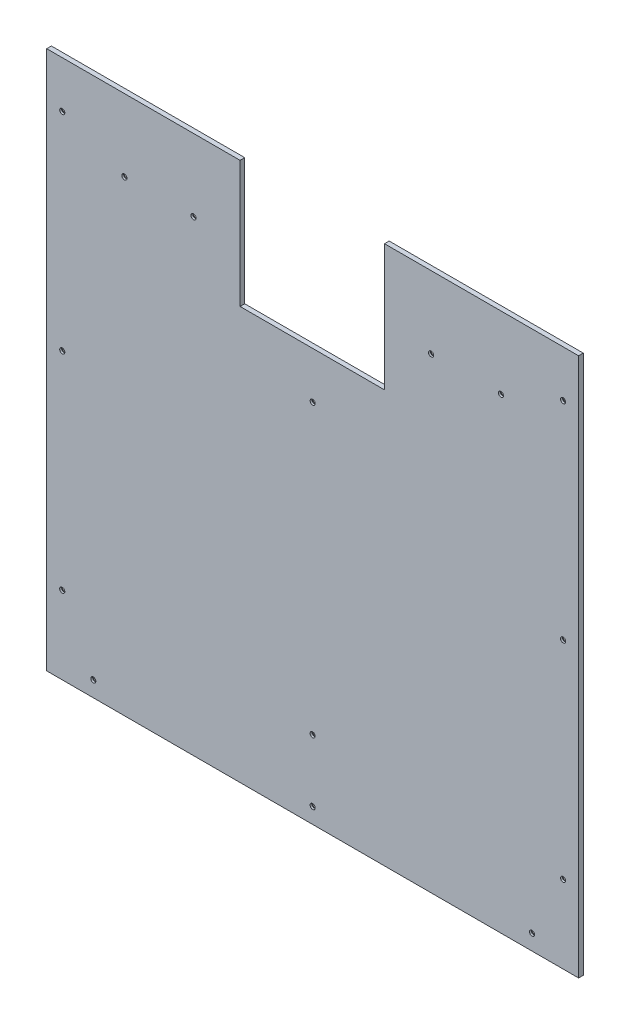
ISO-10303-21;
HEADER;
FILE_DESCRIPTION(('STEP AP214'),'2;1');
FILE_NAME('part.step','',(''),(''),'','','');
FILE_SCHEMA(('AUTOMOTIVE_DESIGN { 1 0 10303 214 1 1 1 1 }'));
ENDSEC;
DATA;
#1=APPLICATION_CONTEXT('core data for automotive mechanical design processes');
#2=APPLICATION_PROTOCOL_DEFINITION('international standard','automotive_design',2000,#1);
#3=PRODUCT_CONTEXT('',#1,'mechanical');
#4=PRODUCT('Part','Part','',(#3));
#5=PRODUCT_RELATED_PRODUCT_CATEGORY('part','',(#4));
#6=PRODUCT_DEFINITION_FORMATION('','',#4);
#7=PRODUCT_DEFINITION_CONTEXT('part definition',#1,'design');
#8=PRODUCT_DEFINITION('design','',#6,#7);
#9=PRODUCT_DEFINITION_SHAPE('','',#8);
#10=(LENGTH_UNIT() NAMED_UNIT(*) SI_UNIT(.MILLI.,.METRE.));
#11=(NAMED_UNIT(*) PLANE_ANGLE_UNIT() SI_UNIT($,.RADIAN.));
#12=(NAMED_UNIT(*) SI_UNIT($,.STERADIAN.) SOLID_ANGLE_UNIT());
#13=UNCERTAINTY_MEASURE_WITH_UNIT(LENGTH_MEASURE(1.E-05),#10,'distance_accuracy_value','');
#14=(GEOMETRIC_REPRESENTATION_CONTEXT(3) GLOBAL_UNCERTAINTY_ASSIGNED_CONTEXT((#13)) GLOBAL_UNIT_ASSIGNED_CONTEXT((#10,
#11,#12)) REPRESENTATION_CONTEXT('',''));
#15=CARTESIAN_POINT('',(0.,0.,0.));
#16=DIRECTION('',(0.,0.,1.));
#17=DIRECTION('',(1.,0.,0.));
#18=AXIS2_PLACEMENT_3D('',#15,#16,#17);
#19=CARTESIAN_POINT('',(0.,0.,-3.));
#20=DIRECTION('',(0.,0.,1.));
#21=DIRECTION('',(1.,0.,0.));
#22=AXIS2_PLACEMENT_3D('',#19,#20,#21);
#23=PLANE('',#22);
#24=CARTESIAN_POINT('',(495.,601.,-2.9999999999859));
#25=DIRECTION('',(0.,0.,-1.));
#26=DIRECTION('',(0.,1.,0.));
#27=AXIS2_PLACEMENT_3D('',#24,#25,#26);
#28=CIRCLE('',#27,6.85500000008232);
#29=CARTESIAN_POINT('',(495.,607.855000000082,-2.9999999999859));
#30=VERTEX_POINT('',#29);
#31=EDGE_CURVE('E93',#30,#30,#28,.F.);
#32=ORIENTED_EDGE('',*,*,#31,.T.);
#33=EDGE_LOOP('',(#32));
#34=FACE_BOUND('',#33,.T.);
#35=CARTESIAN_POINT('',(585.,601.,-2.9999999999859));
#36=DIRECTION('',(0.,0.,-1.));
#37=DIRECTION('',(0.,1.,0.));
#38=AXIS2_PLACEMENT_3D('',#35,#36,#37);
#39=CIRCLE('',#38,6.85499999999362);
#40=CARTESIAN_POINT('',(585.,607.854999999994,-2.9999999999859));
#41=VERTEX_POINT('',#40);
#42=EDGE_CURVE('E151',#41,#41,#39,.F.);
#43=ORIENTED_EDGE('',*,*,#42,.T.);
#44=EDGE_LOOP('',(#43));
#45=FACE_BOUND('',#44,.T.);
#46=CARTESIAN_POINT('',(189.,601.,-3.00000000004275));
#47=DIRECTION('',(0.,0.,-1.));
#48=DIRECTION('',(0.,1.,0.));
#49=AXIS2_PLACEMENT_3D('',#46,#47,#48);
#50=CIRCLE('',#49,6.8550000000655);
#51=CARTESIAN_POINT('',(189.,607.855000000066,-3.00000000004275));
#52=VERTEX_POINT('',#51);
#53=EDGE_CURVE('E154',#52,#52,#50,.F.);
#54=ORIENTED_EDGE('',*,*,#53,.T.);
#55=EDGE_LOOP('',(#54));
#56=FACE_BOUND('',#55,.T.);
#57=CARTESIAN_POINT('',(100.,601.,-2.9999999999859));
#58=DIRECTION('',(0.,0.,-1.));
#59=DIRECTION('',(-1.,0.,0.));
#60=AXIS2_PLACEMENT_3D('',#57,#58,#59);
#61=CIRCLE('',#60,6.85499999995046);
#62=CARTESIAN_POINT('',(93.1450000000495,601.,-2.9999999999859));
#63=VERTEX_POINT('',#62);
#64=EDGE_CURVE('E157',#63,#63,#61,.F.);
#65=ORIENTED_EDGE('',*,*,#64,.T.);
#66=EDGE_LOOP('',(#65));
#67=FACE_BOUND('',#66,.T.);
#68=CARTESIAN_POINT('',(342.5,100.,-2.9999999999859));
#69=DIRECTION('',(0.,0.,-1.));
#70=DIRECTION('',(0.,1.,0.));
#71=AXIS2_PLACEMENT_3D('',#68,#69,#70);
#72=CIRCLE('',#71,6.85500000005734);
#73=CARTESIAN_POINT('',(342.5,106.855000000057,-2.9999999999859));
#74=VERTEX_POINT('',#73);
#75=EDGE_CURVE('E160',#74,#74,#72,.F.);
#76=ORIENTED_EDGE('',*,*,#75,.T.);
#77=EDGE_LOOP('',(#76));
#78=FACE_BOUND('',#77,.T.);
#79=CARTESIAN_POINT('',(342.5,471.,-2.9999999999859));
#80=DIRECTION('',(0.,0.,-1.));
#81=DIRECTION('',(0.,1.,0.));
#82=AXIS2_PLACEMENT_3D('',#79,#80,#81);
#83=CIRCLE('',#82,6.85500000005734);
#84=CARTESIAN_POINT('',(342.5,477.855000000057,-2.9999999999859));
#85=VERTEX_POINT('',#84);
#86=EDGE_CURVE('E163',#85,#85,#83,.F.);
#87=ORIENTED_EDGE('',*,*,#86,.T.);
#88=EDGE_LOOP('',(#87));
#89=FACE_BOUND('',#88,.T.);
#90=CARTESIAN_POINT('',(665.,634.,-2.9999999999859));
#91=DIRECTION('',(0.,0.,-1.));
#92=DIRECTION('',(0.,1.,0.));
#93=AXIS2_PLACEMENT_3D('',#90,#91,#92);
#94=CIRCLE('',#93,6.8550000000096);
#95=CARTESIAN_POINT('',(665.,640.85500000001,-2.9999999999859));
#96=VERTEX_POINT('',#95);
#97=EDGE_CURVE('E166',#96,#96,#94,.F.);
#98=ORIENTED_EDGE('',*,*,#97,.T.);
#99=EDGE_LOOP('',(#98));
#100=FACE_BOUND('',#99,.T.);
#101=CARTESIAN_POINT('',(665.,100.,-2.9999999999859));
#102=DIRECTION('',(0.,0.,-1.));
#103=DIRECTION('',(0.,1.,0.));
#104=AXIS2_PLACEMENT_3D('',#101,#102,#103);
#105=CIRCLE('',#104,6.8550000000096);
#106=CARTESIAN_POINT('',(665.,106.85500000001,-2.9999999999859));
#107=VERTEX_POINT('',#106);
#108=EDGE_CURVE('E169',#107,#107,#105,.F.);
#109=ORIENTED_EDGE('',*,*,#108,.T.);
#110=EDGE_LOOP('',(#109));
#111=FACE_BOUND('',#110,.T.);
#112=CARTESIAN_POINT('',(665.,367.,-2.9999999999859));
#113=DIRECTION('',(0.,0.,-1.));
#114=DIRECTION('',(0.,1.,0.));
#115=AXIS2_PLACEMENT_3D('',#112,#113,#114);
#116=CIRCLE('',#115,6.8550000000096);
#117=CARTESIAN_POINT('',(665.,373.85500000001,-2.9999999999859));
#118=VERTEX_POINT('',#117);
#119=EDGE_CURVE('E172',#118,#118,#116,.F.);
#120=ORIENTED_EDGE('',*,*,#119,.T.);
#121=EDGE_LOOP('',(#120));
#122=FACE_BOUND('',#121,.T.);
#123=CARTESIAN_POINT('',(60.,20.,-2.9999999999859));
#124=DIRECTION('',(0.,0.,-1.));
#125=DIRECTION('',(-1.,0.,0.));
#126=AXIS2_PLACEMENT_3D('',#123,#124,#125);
#127=CIRCLE('',#126,6.85499999997091);
#128=CARTESIAN_POINT('',(53.1450000000291,20.,-2.9999999999859));
#129=VERTEX_POINT('',#128);
#130=EDGE_CURVE('E175',#129,#129,#127,.F.);
#131=ORIENTED_EDGE('',*,*,#130,.T.);
#132=EDGE_LOOP('',(#131));
#133=FACE_BOUND('',#132,.T.);
#134=CARTESIAN_POINT('',(625.,20.,-2.9999999999859));
#135=DIRECTION('',(0.,0.,-1.));
#136=DIRECTION('',(0.,1.,0.));
#137=AXIS2_PLACEMENT_3D('',#134,#135,#136);
#138=CIRCLE('',#137,6.85499999997319);
#139=CARTESIAN_POINT('',(625.,26.8549999999732,-2.9999999999859));
#140=VERTEX_POINT('',#139);
#141=EDGE_CURVE('E178',#140,#140,#138,.F.);
#142=ORIENTED_EDGE('',*,*,#141,.T.);
#143=EDGE_LOOP('',(#142));
#144=FACE_BOUND('',#143,.T.);
#145=CARTESIAN_POINT('',(342.5,20.,-2.9999999999859));
#146=DIRECTION('',(0.,0.,-1.));
#147=DIRECTION('',(0.,1.,0.));
#148=AXIS2_PLACEMENT_3D('',#145,#146,#147);
#149=CIRCLE('',#148,6.85500000005734);
#150=CARTESIAN_POINT('',(342.5,26.8550000000573,-2.9999999999859));
#151=VERTEX_POINT('',#150);
#152=EDGE_CURVE('E181',#151,#151,#149,.F.);
#153=ORIENTED_EDGE('',*,*,#152,.T.);
#154=EDGE_LOOP('',(#153));
#155=FACE_BOUND('',#154,.T.);
#156=CARTESIAN_POINT('',(20.,100.,-2.9999999999859));
#157=DIRECTION('',(0.,0.,-1.));
#158=DIRECTION('',(-1.,0.,0.));
#159=AXIS2_PLACEMENT_3D('',#156,#157,#158);
#160=CIRCLE('',#159,6.85499999993453);
#161=CARTESIAN_POINT('',(13.1450000000655,100.,-2.9999999999859));
#162=VERTEX_POINT('',#161);
#163=EDGE_CURVE('E184',#162,#162,#160,.F.);
#164=ORIENTED_EDGE('',*,*,#163,.T.);
#165=EDGE_LOOP('',(#164));
#166=FACE_BOUND('',#165,.T.);
#167=CARTESIAN_POINT('',(20.,634.,-2.9999999999859));
#168=DIRECTION('',(0.,0.,-1.));
#169=DIRECTION('',(-1.,0.,0.));
#170=AXIS2_PLACEMENT_3D('',#167,#168,#169);
#171=CIRCLE('',#170,6.85499999993453);
#172=CARTESIAN_POINT('',(13.1450000000655,634.,-2.9999999999859));
#173=VERTEX_POINT('',#172);
#174=EDGE_CURVE('E186',#173,#173,#171,.F.);
#175=ORIENTED_EDGE('',*,*,#174,.T.);
#176=EDGE_LOOP('',(#175));
#177=FACE_BOUND('',#176,.T.);
#178=CARTESIAN_POINT('',(20.,367.,-2.9999999999859));
#179=DIRECTION('',(0.,0.,-1.));
#180=DIRECTION('',(-1.,0.,0.));
#181=AXIS2_PLACEMENT_3D('',#178,#179,#180);
#182=CIRCLE('',#181,6.85499999993453);
#183=CARTESIAN_POINT('',(13.1450000000655,367.,-2.9999999999859));
#184=VERTEX_POINT('',#183);
#185=EDGE_CURVE('E20',#184,#184,#182,.F.);
#186=ORIENTED_EDGE('',*,*,#185,.T.);
#187=EDGE_LOOP('',(#186));
#188=FACE_BOUND('',#187,.T.);
#189=DIRECTION('',(1.,0.,0.));
#190=VECTOR('',#189,1.);
#191=CARTESIAN_POINT('',(249.,694.,-3.));
#192=LINE('',#191,#190);
#193=CARTESIAN_POINT('',(249.,694.,-3.));
#194=VERTEX_POINT('',#193);
#195=CARTESIAN_POINT('',(0.,694.,-3.));
#196=VERTEX_POINT('',#195);
#197=EDGE_CURVE('E203',#194,#196,#192,.F.);
#198=ORIENTED_EDGE('',*,*,#197,.F.);
#199=DIRECTION('',(0.,1.,0.));
#200=VECTOR('',#199,1.);
#201=CARTESIAN_POINT('',(249.,531.,-3.));
#202=LINE('',#201,#200);
#203=CARTESIAN_POINT('',(249.,531.,-3.));
#204=VERTEX_POINT('',#203);
#205=EDGE_CURVE('E216',#204,#194,#202,.T.);
#206=ORIENTED_EDGE('',*,*,#205,.F.);
#207=DIRECTION('',(1.,0.,0.));
#208=VECTOR('',#207,1.);
#209=CARTESIAN_POINT('',(435.,531.,-3.));
#210=LINE('',#209,#208);
#211=CARTESIAN_POINT('',(435.,531.,-3.));
#212=VERTEX_POINT('',#211);
#213=EDGE_CURVE('E221',#212,#204,#210,.F.);
#214=ORIENTED_EDGE('',*,*,#213,.F.);
#215=DIRECTION('',(0.,1.,0.));
#216=VECTOR('',#215,1.);
#217=CARTESIAN_POINT('',(435.,694.,-3.));
#218=LINE('',#217,#216);
#219=CARTESIAN_POINT('',(435.,694.,-3.));
#220=VERTEX_POINT('',#219);
#221=EDGE_CURVE('E226',#220,#212,#218,.F.);
#222=ORIENTED_EDGE('',*,*,#221,.F.);
#223=DIRECTION('',(1.,0.,0.));
#224=VECTOR('',#223,1.);
#225=CARTESIAN_POINT('',(685.,694.,-3.));
#226=LINE('',#225,#224);
#227=CARTESIAN_POINT('',(685.,694.,-3.));
#228=VERTEX_POINT('',#227);
#229=EDGE_CURVE('E231',#228,#220,#226,.F.);
#230=ORIENTED_EDGE('',*,*,#229,.F.);
#231=DIRECTION('',(0.,1.,0.));
#232=VECTOR('',#231,1.);
#233=CARTESIAN_POINT('',(685.,0.,-3.));
#234=LINE('',#233,#232);
#235=CARTESIAN_POINT('',(685.,0.,-3.));
#236=VERTEX_POINT('',#235);
#237=EDGE_CURVE('E96',#236,#228,#234,.T.);
#238=ORIENTED_EDGE('',*,*,#237,.F.);
#239=DIRECTION('',(1.,0.,0.));
#240=VECTOR('',#239,1.);
#241=CARTESIAN_POINT('',(0.,0.,-3.));
#242=LINE('',#241,#240);
#243=CARTESIAN_POINT('',(0.,0.,-3.));
#244=VERTEX_POINT('',#243);
#245=EDGE_CURVE('E79',#244,#236,#242,.T.);
#246=ORIENTED_EDGE('',*,*,#245,.F.);
#247=DIRECTION('',(0.,1.,0.));
#248=VECTOR('',#247,1.);
#249=CARTESIAN_POINT('',(0.,694.,-3.));
#250=LINE('',#249,#248);
#251=EDGE_CURVE('E84',#196,#244,#250,.F.);
#252=ORIENTED_EDGE('',*,*,#251,.F.);
#253=EDGE_LOOP('',(#198,#206,#214,#222,#230,#238,#246,#252));
#254=FACE_BOUND('',#253,.T.);
#255=ADVANCED_FACE('F17',(#34,#45,#56,#67,#78,#89,#100,#111,#122,#133,#144,#155,#166,#177,#188,
#254),#23,.F.);
#256=CARTESIAN_POINT('',(20.,367.,-2.99999999992906));
#257=DIRECTION('',(0.,0.,-1.));
#258=DIRECTION('',(-1.,0.,0.));
#259=AXIS2_PLACEMENT_3D('',#256,#257,#258);
#260=CONICAL_SURFACE('',#259,6.85499999987769,0.785397999990634);
#261=ORIENTED_EDGE('',*,*,#185,.F.);
#262=EDGE_LOOP('',(#261));
#263=FACE_BOUND('',#262,.T.);
#264=CARTESIAN_POINT('',(20.,367.,0.555001161756055));
#265=DIRECTION('',(0.,0.,-1.));
#266=DIRECTION('',(-1.,0.,0.));
#267=AXIS2_PLACEMENT_3D('',#264,#265,#266);
#268=CIRCLE('',#267,3.29999999999999);
#269=CARTESIAN_POINT('',(16.7,367.,0.555001161756055));
#270=VERTEX_POINT('',#269);
#271=EDGE_CURVE('E200',#270,#270,#268,.F.);
#272=ORIENTED_EDGE('',*,*,#271,.T.);
#273=EDGE_LOOP('',(#272));
#274=FACE_BOUND('',#273,.T.);
#275=ADVANCED_FACE('F194',(#263,#274),#260,.F.);
#276=CARTESIAN_POINT('',(20.,634.,-2.99999999992906));
#277=DIRECTION('',(0.,0.,-1.));
#278=DIRECTION('',(-1.,0.,0.));
#279=AXIS2_PLACEMENT_3D('',#276,#277,#278);
#280=CONICAL_SURFACE('',#279,6.85499999987769,0.785397999990634);
#281=ORIENTED_EDGE('',*,*,#174,.F.);
#282=EDGE_LOOP('',(#281));
#283=FACE_BOUND('',#282,.T.);
#284=CARTESIAN_POINT('',(20.,634.,0.555001161756055));
#285=DIRECTION('',(0.,0.,-1.));
#286=DIRECTION('',(-1.,0.,0.));
#287=AXIS2_PLACEMENT_3D('',#284,#285,#286);
#288=CIRCLE('',#287,3.29999999999999);
#289=CARTESIAN_POINT('',(16.7,634.,0.555001161756055));
#290=VERTEX_POINT('',#289);
#291=EDGE_CURVE('E202',#290,#290,#288,.F.);
#292=ORIENTED_EDGE('',*,*,#291,.T.);
#293=EDGE_LOOP('',(#292));
#294=FACE_BOUND('',#293,.T.);
#295=ADVANCED_FACE('F197',(#283,#294),#280,.F.);
#296=CARTESIAN_POINT('',(20.,100.,-2.99999999992906));
#297=DIRECTION('',(0.,0.,-1.));
#298=DIRECTION('',(-1.,0.,0.));
#299=AXIS2_PLACEMENT_3D('',#296,#297,#298);
#300=CONICAL_SURFACE('',#299,6.85499999987769,0.785397999990634);
#301=ORIENTED_EDGE('',*,*,#163,.F.);
#302=EDGE_LOOP('',(#301));
#303=FACE_BOUND('',#302,.T.);
#304=CARTESIAN_POINT('',(20.,100.,0.555001161756055));
#305=DIRECTION('',(0.,0.,-1.));
#306=DIRECTION('',(-1.,0.,0.));
#307=AXIS2_PLACEMENT_3D('',#304,#305,#306);
#308=CIRCLE('',#307,3.29999999999999);
#309=CARTESIAN_POINT('',(16.7,100.,0.555001161756055));
#310=VERTEX_POINT('',#309);
#311=EDGE_CURVE('E206',#310,#310,#308,.F.);
#312=ORIENTED_EDGE('',*,*,#311,.T.);
#313=EDGE_LOOP('',(#312));
#314=FACE_BOUND('',#313,.T.);
#315=ADVANCED_FACE('F319',(#303,#314),#300,.F.);
#316=CARTESIAN_POINT('',(342.5,20.,-2.99999999987222));
#317=DIRECTION('',(0.,0.,-1.));
#318=DIRECTION('',(0.,1.,0.));
#319=AXIS2_PLACEMENT_3D('',#316,#317,#318);
#320=CONICAL_SURFACE('',#319,6.85499999994366,0.785398000006624);
#321=ORIENTED_EDGE('',*,*,#152,.F.);
#322=EDGE_LOOP('',(#321));
#323=FACE_BOUND('',#322,.T.);
#324=CARTESIAN_POINT('',(342.5,20.,0.555001161756055));
#325=DIRECTION('',(0.,0.,-1.));
#326=DIRECTION('',(-1.,0.,0.));
#327=AXIS2_PLACEMENT_3D('',#324,#325,#326);
#328=CIRCLE('',#327,3.29999999999997);
#329=CARTESIAN_POINT('',(339.2,20.,0.555001161756055));
#330=VERTEX_POINT('',#329);
#331=EDGE_CURVE('E307',#330,#330,#328,.F.);
#332=ORIENTED_EDGE('',*,*,#331,.T.);
#333=EDGE_LOOP('',(#332));
#334=FACE_BOUND('',#333,.T.);
#335=ADVANCED_FACE('F416',(#323,#334),#320,.F.);
#336=CARTESIAN_POINT('',(625.,20.,-2.99999999987222));
#337=DIRECTION('',(0.,0.,-1.));
#338=DIRECTION('',(0.,1.,0.));
#339=AXIS2_PLACEMENT_3D('',#336,#337,#338);
#340=CONICAL_SURFACE('',#339,6.8549999998595,0.785398000006624);
#341=ORIENTED_EDGE('',*,*,#141,.F.);
#342=EDGE_LOOP('',(#341));
#343=FACE_BOUND('',#342,.T.);
#344=CARTESIAN_POINT('',(625.,20.,0.555001161756055));
#345=DIRECTION('',(0.,0.,-1.));
#346=DIRECTION('',(-1.,0.,0.));
#347=AXIS2_PLACEMENT_3D('',#344,#345,#346);
#348=CIRCLE('',#347,3.29999999999997);
#349=CARTESIAN_POINT('',(621.7,20.,0.555001161756055));
#350=VERTEX_POINT('',#349);
#351=EDGE_CURVE('E302',#350,#350,#348,.F.);
#352=ORIENTED_EDGE('',*,*,#351,.T.);
#353=EDGE_LOOP('',(#352));
#354=FACE_BOUND('',#353,.T.);
#355=ADVANCED_FACE('F412',(#343,#354),#340,.F.);
#356=CARTESIAN_POINT('',(60.,20.,-2.99999999992906));
#357=DIRECTION('',(0.,0.,-1.));
#358=DIRECTION('',(-1.,0.,0.));
#359=AXIS2_PLACEMENT_3D('',#356,#357,#358);
#360=CONICAL_SURFACE('',#359,6.85499999991407,0.785397999990634);
#361=ORIENTED_EDGE('',*,*,#130,.F.);
#362=EDGE_LOOP('',(#361));
#363=FACE_BOUND('',#362,.T.);
#364=CARTESIAN_POINT('',(60.,20.,0.555001161756055));
#365=DIRECTION('',(0.,0.,-1.));
#366=DIRECTION('',(-1.,0.,0.));
#367=AXIS2_PLACEMENT_3D('',#364,#365,#366);
#368=CIRCLE('',#367,3.29999999999998);
#369=CARTESIAN_POINT('',(56.7,20.,0.555001161756055));
#370=VERTEX_POINT('',#369);
#371=EDGE_CURVE('E297',#370,#370,#368,.F.);
#372=ORIENTED_EDGE('',*,*,#371,.T.);
#373=EDGE_LOOP('',(#372));
#374=FACE_BOUND('',#373,.T.);
#375=ADVANCED_FACE('F408',(#363,#374),#360,.F.);
#376=CARTESIAN_POINT('',(665.,367.,-2.99999999987222));
#377=DIRECTION('',(0.,0.,-1.));
#378=DIRECTION('',(0.,1.,0.));
#379=AXIS2_PLACEMENT_3D('',#376,#377,#378);
#380=CONICAL_SURFACE('',#379,6.85499999989592,0.785398000006624);
#381=ORIENTED_EDGE('',*,*,#119,.F.);
#382=EDGE_LOOP('',(#381));
#383=FACE_BOUND('',#382,.T.);
#384=CARTESIAN_POINT('',(665.,367.,0.555001161756055));
#385=DIRECTION('',(0.,0.,-1.));
#386=DIRECTION('',(-1.,0.,0.));
#387=AXIS2_PLACEMENT_3D('',#384,#385,#386);
#388=CIRCLE('',#387,3.29999999999997);
#389=CARTESIAN_POINT('',(661.7,367.,0.555001161756055));
#390=VERTEX_POINT('',#389);
#391=EDGE_CURVE('E292',#390,#390,#388,.F.);
#392=ORIENTED_EDGE('',*,*,#391,.T.);
#393=EDGE_LOOP('',(#392));
#394=FACE_BOUND('',#393,.T.);
#395=ADVANCED_FACE('F404',(#383,#394),#380,.F.);
#396=CARTESIAN_POINT('',(665.,100.,-2.99999999987222));
#397=DIRECTION('',(0.,0.,-1.));
#398=DIRECTION('',(0.,1.,0.));
#399=AXIS2_PLACEMENT_3D('',#396,#397,#398);
#400=CONICAL_SURFACE('',#399,6.85499999989592,0.785398000006624);
#401=ORIENTED_EDGE('',*,*,#108,.F.);
#402=EDGE_LOOP('',(#401));
#403=FACE_BOUND('',#402,.T.);
#404=CARTESIAN_POINT('',(665.,100.,0.555001161756055));
#405=DIRECTION('',(0.,0.,-1.));
#406=DIRECTION('',(-1.,0.,0.));
#407=AXIS2_PLACEMENT_3D('',#404,#405,#406);
#408=CIRCLE('',#407,3.29999999999997);
#409=CARTESIAN_POINT('',(661.7,100.,0.555001161756055));
#410=VERTEX_POINT('',#409);
#411=EDGE_CURVE('E287',#410,#410,#408,.F.);
#412=ORIENTED_EDGE('',*,*,#411,.T.);
#413=EDGE_LOOP('',(#412));
#414=FACE_BOUND('',#413,.T.);
#415=ADVANCED_FACE('F400',(#403,#414),#400,.F.);
#416=CARTESIAN_POINT('',(665.,634.,-2.99999999987222));
#417=DIRECTION('',(0.,0.,-1.));
#418=DIRECTION('',(0.,1.,0.));
#419=AXIS2_PLACEMENT_3D('',#416,#417,#418);
#420=CONICAL_SURFACE('',#419,6.85499999989592,0.785398000006624);
#421=ORIENTED_EDGE('',*,*,#97,.F.);
#422=EDGE_LOOP('',(#421));
#423=FACE_BOUND('',#422,.T.);
#424=CARTESIAN_POINT('',(665.,634.,0.555001161756055));
#425=DIRECTION('',(0.,0.,-1.));
#426=DIRECTION('',(-1.,0.,0.));
#427=AXIS2_PLACEMENT_3D('',#424,#425,#426);
#428=CIRCLE('',#427,3.29999999999997);
#429=CARTESIAN_POINT('',(661.7,634.,0.555001161756055));
#430=VERTEX_POINT('',#429);
#431=EDGE_CURVE('E282',#430,#430,#428,.F.);
#432=ORIENTED_EDGE('',*,*,#431,.T.);
#433=EDGE_LOOP('',(#432));
#434=FACE_BOUND('',#433,.T.);
#435=ADVANCED_FACE('F396',(#423,#434),#420,.F.);
#436=CARTESIAN_POINT('',(342.5,471.,-2.99999999987222));
#437=DIRECTION('',(0.,0.,-1.));
#438=DIRECTION('',(0.,1.,0.));
#439=AXIS2_PLACEMENT_3D('',#436,#437,#438);
#440=CONICAL_SURFACE('',#439,6.85499999994366,0.785398000006624);
#441=ORIENTED_EDGE('',*,*,#86,.F.);
#442=EDGE_LOOP('',(#441));
#443=FACE_BOUND('',#442,.T.);
#444=CARTESIAN_POINT('',(342.5,471.,0.555001161756055));
#445=DIRECTION('',(0.,0.,-1.));
#446=DIRECTION('',(-1.,0.,0.));
#447=AXIS2_PLACEMENT_3D('',#444,#445,#446);
#448=CIRCLE('',#447,3.29999999999997);
#449=CARTESIAN_POINT('',(339.2,471.,0.555001161756055));
#450=VERTEX_POINT('',#449);
#451=EDGE_CURVE('E277',#450,#450,#448,.F.);
#452=ORIENTED_EDGE('',*,*,#451,.T.);
#453=EDGE_LOOP('',(#452));
#454=FACE_BOUND('',#453,.T.);
#455=ADVANCED_FACE('F392',(#443,#454),#440,.F.);
#456=CARTESIAN_POINT('',(342.5,100.,-2.99999999987222));
#457=DIRECTION('',(0.,0.,-1.));
#458=DIRECTION('',(0.,1.,0.));
#459=AXIS2_PLACEMENT_3D('',#456,#457,#458);
#460=CONICAL_SURFACE('',#459,6.85499999994366,0.785398000006624);
#461=ORIENTED_EDGE('',*,*,#75,.F.);
#462=EDGE_LOOP('',(#461));
#463=FACE_BOUND('',#462,.T.);
#464=CARTESIAN_POINT('',(342.5,100.,0.555001161756055));
#465=DIRECTION('',(0.,0.,-1.));
#466=DIRECTION('',(-1.,0.,0.));
#467=AXIS2_PLACEMENT_3D('',#464,#465,#466);
#468=CIRCLE('',#467,3.29999999999997);
#469=CARTESIAN_POINT('',(339.2,100.,0.555001161756055));
#470=VERTEX_POINT('',#469);
#471=EDGE_CURVE('E272',#470,#470,#468,.F.);
#472=ORIENTED_EDGE('',*,*,#471,.T.);
#473=EDGE_LOOP('',(#472));
#474=FACE_BOUND('',#473,.T.);
#475=ADVANCED_FACE('F388',(#463,#474),#460,.F.);
#476=CARTESIAN_POINT('',(100.,601.,-2.99999999992906));
#477=DIRECTION('',(0.,0.,-1.));
#478=DIRECTION('',(-1.,0.,0.));
#479=AXIS2_PLACEMENT_3D('',#476,#477,#478);
#480=CONICAL_SURFACE('',#479,6.85499999989361,0.785397999990634);
#481=ORIENTED_EDGE('',*,*,#64,.F.);
#482=EDGE_LOOP('',(#481));
#483=FACE_BOUND('',#482,.T.);
#484=CARTESIAN_POINT('',(100.,601.,0.555001161756055));
#485=DIRECTION('',(0.,0.,-1.));
#486=DIRECTION('',(-1.,0.,0.));
#487=AXIS2_PLACEMENT_3D('',#484,#485,#486);
#488=CIRCLE('',#487,3.29999999999998);
#489=CARTESIAN_POINT('',(96.7,601.,0.555001161756055));
#490=VERTEX_POINT('',#489);
#491=EDGE_CURVE('E267',#490,#490,#488,.F.);
#492=ORIENTED_EDGE('',*,*,#491,.T.);
#493=EDGE_LOOP('',(#492));
#494=FACE_BOUND('',#493,.T.);
#495=ADVANCED_FACE('F384',(#483,#494),#480,.F.);
#496=CARTESIAN_POINT('',(189.,601.,-3.00000000004275));
#497=DIRECTION('',(0.,0.,-1.));
#498=DIRECTION('',(0.,1.,0.));
#499=AXIS2_PLACEMENT_3D('',#496,#497,#498);
#500=CONICAL_SURFACE('',#499,6.8550000000655,0.785397999990634);
#501=ORIENTED_EDGE('',*,*,#53,.F.);
#502=EDGE_LOOP('',(#501));
#503=FACE_BOUND('',#502,.T.);
#504=CARTESIAN_POINT('',(189.,601.,0.555001161756055));
#505=DIRECTION('',(0.,0.,-1.));
#506=DIRECTION('',(-1.,0.,0.));
#507=AXIS2_PLACEMENT_3D('',#504,#505,#506);
#508=CIRCLE('',#507,3.3);
#509=CARTESIAN_POINT('',(185.7,601.,0.555001161756055));
#510=VERTEX_POINT('',#509);
#511=EDGE_CURVE('E262',#510,#510,#508,.F.);
#512=ORIENTED_EDGE('',*,*,#511,.T.);
#513=EDGE_LOOP('',(#512));
#514=FACE_BOUND('',#513,.T.);
#515=ADVANCED_FACE('F380',(#503,#514),#500,.F.);
#516=CARTESIAN_POINT('',(585.,601.,-2.99999999987222));
#517=DIRECTION('',(0.,0.,-1.));
#518=DIRECTION('',(0.,1.,0.));
#519=AXIS2_PLACEMENT_3D('',#516,#517,#518);
#520=CONICAL_SURFACE('',#519,6.85499999987993,0.785398000006624);
#521=ORIENTED_EDGE('',*,*,#42,.F.);
#522=EDGE_LOOP('',(#521));
#523=FACE_BOUND('',#522,.T.);
#524=CARTESIAN_POINT('',(585.,601.,0.555001161756055));
#525=DIRECTION('',(0.,0.,-1.));
#526=DIRECTION('',(-1.,0.,0.));
#527=AXIS2_PLACEMENT_3D('',#524,#525,#526);
#528=CIRCLE('',#527,3.29999999999997);
#529=CARTESIAN_POINT('',(581.7,601.,0.555001161756055));
#530=VERTEX_POINT('',#529);
#531=EDGE_CURVE('E257',#530,#530,#528,.F.);
#532=ORIENTED_EDGE('',*,*,#531,.T.);
#533=EDGE_LOOP('',(#532));
#534=FACE_BOUND('',#533,.T.);
#535=ADVANCED_FACE('F376',(#523,#534),#520,.F.);
#536=CARTESIAN_POINT('',(495.,601.,-3.00000000004275));
#537=DIRECTION('',(0.,0.,-1.));
#538=DIRECTION('',(0.,1.,0.));
#539=AXIS2_PLACEMENT_3D('',#536,#537,#538);
#540=CONICAL_SURFACE('',#539,6.85500000013917,0.785398000006624);
#541=ORIENTED_EDGE('',*,*,#31,.F.);
#542=EDGE_LOOP('',(#541));
#543=FACE_BOUND('',#542,.T.);
#544=CARTESIAN_POINT('',(495.,601.,0.555001161756055));
#545=DIRECTION('',(0.,0.,-1.));
#546=DIRECTION('',(-1.,0.,0.));
#547=AXIS2_PLACEMENT_3D('',#544,#545,#546);
#548=CIRCLE('',#547,3.29999999999997);
#549=CARTESIAN_POINT('',(491.7,601.,0.555001161756055));
#550=VERTEX_POINT('',#549);
#551=EDGE_CURVE('E251',#550,#550,#548,.F.);
#552=ORIENTED_EDGE('',*,*,#551,.T.);
#553=EDGE_LOOP('',(#552));
#554=FACE_BOUND('',#553,.T.);
#555=ADVANCED_FACE('F373',(#543,#554),#540,.F.);
#556=CARTESIAN_POINT('',(0.,694.,-3.));
#557=DIRECTION('',(-1.,0.,0.));
#558=DIRECTION('',(0.,0.,1.));
#559=AXIS2_PLACEMENT_3D('',#556,#557,#558);
#560=PLANE('',#559);
#561=DIRECTION('',(0.,0.,1.));
#562=VECTOR('',#561,1.);
#563=CARTESIAN_POINT('',(0.,694.,-3.));
#564=LINE('',#563,#562);
#565=CARTESIAN_POINT('',(0.,694.,3.));
#566=VERTEX_POINT('',#565);
#567=EDGE_CURVE('E89',#196,#566,#564,.T.);
#568=ORIENTED_EDGE('',*,*,#567,.F.);
#569=ORIENTED_EDGE('',*,*,#251,.T.);
#570=DIRECTION('',(0.,0.,-1.));
#571=VECTOR('',#570,1.);
#572=CARTESIAN_POINT('',(0.,0.,-3.));
#573=LINE('',#572,#571);
#574=CARTESIAN_POINT('',(0.,0.,3.));
#575=VERTEX_POINT('',#574);
#576=EDGE_CURVE('E86',#575,#244,#573,.T.);
#577=ORIENTED_EDGE('',*,*,#576,.F.);
#578=DIRECTION('',(0.,1.,0.));
#579=VECTOR('',#578,1.);
#580=CARTESIAN_POINT('',(0.,0.,3.));
#581=LINE('',#580,#579);
#582=EDGE_CURVE('E249',#566,#575,#581,.F.);
#583=ORIENTED_EDGE('',*,*,#582,.F.);
#584=EDGE_LOOP('',(#568,#569,#577,#583));
#585=FACE_BOUND('',#584,.T.);
#586=ADVANCED_FACE('F85',(#585),#560,.T.);
#587=CARTESIAN_POINT('',(0.,0.,-3.));
#588=DIRECTION('',(0.,-1.,0.));
#589=DIRECTION('',(0.,0.,-1.));
#590=AXIS2_PLACEMENT_3D('',#587,#588,#589);
#591=PLANE('',#590);
#592=ORIENTED_EDGE('',*,*,#576,.T.);
#593=ORIENTED_EDGE('',*,*,#245,.T.);
#594=DIRECTION('',(0.,0.,-1.));
#595=VECTOR('',#594,1.);
#596=CARTESIAN_POINT('',(685.,0.,-3.));
#597=LINE('',#596,#595);
#598=CARTESIAN_POINT('',(685.,0.,3.));
#599=VERTEX_POINT('',#598);
#600=EDGE_CURVE('E98',#599,#236,#597,.T.);
#601=ORIENTED_EDGE('',*,*,#600,.F.);
#602=DIRECTION('',(1.,0.,0.));
#603=VECTOR('',#602,1.);
#604=CARTESIAN_POINT('',(0.,0.,3.));
#605=LINE('',#604,#603);
#606=EDGE_CURVE('E102',#575,#599,#605,.T.);
#607=ORIENTED_EDGE('',*,*,#606,.F.);
#608=EDGE_LOOP('',(#592,#593,#601,#607));
#609=FACE_BOUND('',#608,.T.);
#610=ADVANCED_FACE('F100',(#609),#591,.T.);
#611=CARTESIAN_POINT('',(685.,0.,-3.));
#612=DIRECTION('',(1.,0.,0.));
#613=DIRECTION('',(0.,0.,-1.));
#614=AXIS2_PLACEMENT_3D('',#611,#612,#613);
#615=PLANE('',#614);
#616=ORIENTED_EDGE('',*,*,#600,.T.);
#617=ORIENTED_EDGE('',*,*,#237,.T.);
#618=DIRECTION('',(0.,0.,1.));
#619=VECTOR('',#618,1.);
#620=CARTESIAN_POINT('',(685.,694.,-3.));
#621=LINE('',#620,#619);
#622=CARTESIAN_POINT('',(685.,694.,3.));
#623=VERTEX_POINT('',#622);
#624=EDGE_CURVE('E233',#623,#228,#621,.F.);
#625=ORIENTED_EDGE('',*,*,#624,.F.);
#626=DIRECTION('',(0.,1.,0.));
#627=VECTOR('',#626,1.);
#628=CARTESIAN_POINT('',(685.,0.,3.));
#629=LINE('',#628,#627);
#630=EDGE_CURVE('E240',#599,#623,#629,.T.);
#631=ORIENTED_EDGE('',*,*,#630,.F.);
#632=EDGE_LOOP('',(#616,#617,#625,#631));
#633=FACE_BOUND('',#632,.T.);
#634=ADVANCED_FACE('F238',(#633),#615,.T.);
#635=CARTESIAN_POINT('',(685.,694.,-3.));
#636=DIRECTION('',(0.,1.,0.));
#637=DIRECTION('',(0.,0.,1.));
#638=AXIS2_PLACEMENT_3D('',#635,#636,#637);
#639=PLANE('',#638);
#640=ORIENTED_EDGE('',*,*,#624,.T.);
#641=ORIENTED_EDGE('',*,*,#229,.T.);
#642=DIRECTION('',(0.,0.,1.));
#643=VECTOR('',#642,1.);
#644=CARTESIAN_POINT('',(435.,694.,-3.));
#645=LINE('',#644,#643);
#646=CARTESIAN_POINT('',(435.,694.,3.));
#647=VERTEX_POINT('',#646);
#648=EDGE_CURVE('E228',#647,#220,#645,.F.);
#649=ORIENTED_EDGE('',*,*,#648,.F.);
#650=DIRECTION('',(1.,0.,0.));
#651=VECTOR('',#650,1.);
#652=CARTESIAN_POINT('',(0.,694.,3.));
#653=LINE('',#652,#651);
#654=EDGE_CURVE('E244',#623,#647,#653,.F.);
#655=ORIENTED_EDGE('',*,*,#654,.F.);
#656=EDGE_LOOP('',(#640,#641,#649,#655));
#657=FACE_BOUND('',#656,.T.);
#658=ADVANCED_FACE('F362',(#657),#639,.T.);
#659=CARTESIAN_POINT('',(435.,694.,-3.));
#660=DIRECTION('',(-1.,0.,0.));
#661=DIRECTION('',(0.,0.,1.));
#662=AXIS2_PLACEMENT_3D('',#659,#660,#661);
#663=PLANE('',#662);
#664=ORIENTED_EDGE('',*,*,#648,.T.);
#665=ORIENTED_EDGE('',*,*,#221,.T.);
#666=DIRECTION('',(0.,0.,1.));
#667=VECTOR('',#666,1.);
#668=CARTESIAN_POINT('',(435.,531.,-3.));
#669=LINE('',#668,#667);
#670=CARTESIAN_POINT('',(435.,531.,3.));
#671=VERTEX_POINT('',#670);
#672=EDGE_CURVE('E223',#671,#212,#669,.F.);
#673=ORIENTED_EDGE('',*,*,#672,.F.);
#674=DIRECTION('',(0.,1.,0.));
#675=VECTOR('',#674,1.);
#676=CARTESIAN_POINT('',(435.,0.,3.));
#677=LINE('',#676,#675);
#678=EDGE_CURVE('E809',#647,#671,#677,.F.);
#679=ORIENTED_EDGE('',*,*,#678,.F.);
#680=EDGE_LOOP('',(#664,#665,#673,#679));
#681=FACE_BOUND('',#680,.T.);
#682=ADVANCED_FACE('F358',(#681),#663,.T.);
#683=CARTESIAN_POINT('',(435.,531.,-3.));
#684=DIRECTION('',(0.,1.,0.));
#685=DIRECTION('',(0.,0.,1.));
#686=AXIS2_PLACEMENT_3D('',#683,#684,#685);
#687=PLANE('',#686);
#688=ORIENTED_EDGE('',*,*,#672,.T.);
#689=ORIENTED_EDGE('',*,*,#213,.T.);
#690=DIRECTION('',(0.,0.,-1.));
#691=VECTOR('',#690,1.);
#692=CARTESIAN_POINT('',(249.,531.,-3.));
#693=LINE('',#692,#691);
#694=CARTESIAN_POINT('',(249.,531.,3.));
#695=VERTEX_POINT('',#694);
#696=EDGE_CURVE('E218',#695,#204,#693,.T.);
#697=ORIENTED_EDGE('',*,*,#696,.F.);
#698=DIRECTION('',(1.,0.,0.));
#699=VECTOR('',#698,1.);
#700=CARTESIAN_POINT('',(0.,531.,3.));
#701=LINE('',#700,#699);
#702=EDGE_CURVE('E810',#671,#695,#701,.F.);
#703=ORIENTED_EDGE('',*,*,#702,.F.);
#704=EDGE_LOOP('',(#688,#689,#697,#703));
#705=FACE_BOUND('',#704,.T.);
#706=ADVANCED_FACE('F355',(#705),#687,.T.);
#707=CARTESIAN_POINT('',(249.,531.,-3.));
#708=DIRECTION('',(1.,0.,0.));
#709=DIRECTION('',(0.,0.,-1.));
#710=AXIS2_PLACEMENT_3D('',#707,#708,#709);
#711=PLANE('',#710);
#712=ORIENTED_EDGE('',*,*,#696,.T.);
#713=ORIENTED_EDGE('',*,*,#205,.T.);
#714=DIRECTION('',(0.,0.,1.));
#715=VECTOR('',#714,1.);
#716=CARTESIAN_POINT('',(249.,694.,-3.));
#717=LINE('',#716,#715);
#718=CARTESIAN_POINT('',(249.,694.,3.));
#719=VERTEX_POINT('',#718);
#720=EDGE_CURVE('E35',#719,#194,#717,.F.);
#721=ORIENTED_EDGE('',*,*,#720,.F.);
#722=DIRECTION('',(0.,1.,0.));
#723=VECTOR('',#722,1.);
#724=CARTESIAN_POINT('',(249.,0.,3.));
#725=LINE('',#724,#723);
#726=EDGE_CURVE('E815',#695,#719,#725,.T.);
#727=ORIENTED_EDGE('',*,*,#726,.F.);
#728=EDGE_LOOP('',(#712,#713,#721,#727));
#729=FACE_BOUND('',#728,.T.);
#730=ADVANCED_FACE('F349',(#729),#711,.T.);
#731=CARTESIAN_POINT('',(249.,694.,-3.));
#732=DIRECTION('',(0.,1.,0.));
#733=DIRECTION('',(0.,0.,1.));
#734=AXIS2_PLACEMENT_3D('',#731,#732,#733);
#735=PLANE('',#734);
#736=ORIENTED_EDGE('',*,*,#720,.T.);
#737=ORIENTED_EDGE('',*,*,#197,.T.);
#738=ORIENTED_EDGE('',*,*,#567,.T.);
#739=DIRECTION('',(1.,0.,0.));
#740=VECTOR('',#739,1.);
#741=CARTESIAN_POINT('',(0.,694.,3.));
#742=LINE('',#741,#740);
#743=EDGE_CURVE('E148',#719,#566,#742,.F.);
#744=ORIENTED_EDGE('',*,*,#743,.F.);
#745=EDGE_LOOP('',(#736,#737,#738,#744));
#746=FACE_BOUND('',#745,.T.);
#747=ADVANCED_FACE('F340',(#746),#735,.T.);
#748=CARTESIAN_POINT('',(20.,367.,-3.));
#749=DIRECTION('',(0.,0.,-1.));
#750=DIRECTION('',(-1.,0.,0.));
#751=AXIS2_PLACEMENT_3D('',#748,#749,#750);
#752=CYLINDRICAL_SURFACE('',#751,3.29999999999999);
#753=ORIENTED_EDGE('',*,*,#271,.F.);
#754=EDGE_LOOP('',(#753));
#755=FACE_BOUND('',#754,.T.);
#756=CARTESIAN_POINT('',(20.,367.,3.00000000000001));
#757=DIRECTION('',(0.,0.,-1.));
#758=DIRECTION('',(-1.,0.,0.));
#759=AXIS2_PLACEMENT_3D('',#756,#757,#758);
#760=CIRCLE('',#759,3.29999999999999);
#761=CARTESIAN_POINT('',(16.7,367.,3.00000000000001));
#762=VERTEX_POINT('',#761);
#763=EDGE_CURVE('E145',#762,#762,#760,.T.);
#764=ORIENTED_EDGE('',*,*,#763,.F.);
#765=EDGE_LOOP('',(#764));
#766=FACE_BOUND('',#765,.T.);
#767=ADVANCED_FACE('F338',(#755,#766),#752,.F.);
#768=CARTESIAN_POINT('',(20.,634.,-3.));
#769=DIRECTION('',(0.,0.,-1.));
#770=DIRECTION('',(-1.,0.,0.));
#771=AXIS2_PLACEMENT_3D('',#768,#769,#770);
#772=CYLINDRICAL_SURFACE('',#771,3.29999999999999);
#773=ORIENTED_EDGE('',*,*,#291,.F.);
#774=EDGE_LOOP('',(#773));
#775=FACE_BOUND('',#774,.T.);
#776=CARTESIAN_POINT('',(20.,634.,3.00000000000001));
#777=DIRECTION('',(0.,0.,-1.));
#778=DIRECTION('',(-1.,0.,0.));
#779=AXIS2_PLACEMENT_3D('',#776,#777,#778);
#780=CIRCLE('',#779,3.29999999999999);
#781=CARTESIAN_POINT('',(16.7,634.,3.00000000000001));
#782=VERTEX_POINT('',#781);
#783=EDGE_CURVE('E142',#782,#782,#780,.T.);
#784=ORIENTED_EDGE('',*,*,#783,.F.);
#785=EDGE_LOOP('',(#784));
#786=FACE_BOUND('',#785,.T.);
#787=ADVANCED_FACE('F325',(#775,#786),#772,.F.);
#788=CARTESIAN_POINT('',(20.,100.,-3.));
#789=DIRECTION('',(0.,0.,-1.));
#790=DIRECTION('',(-1.,0.,0.));
#791=AXIS2_PLACEMENT_3D('',#788,#789,#790);
#792=CYLINDRICAL_SURFACE('',#791,3.29999999999999);
#793=ORIENTED_EDGE('',*,*,#311,.F.);
#794=EDGE_LOOP('',(#793));
#795=FACE_BOUND('',#794,.T.);
#796=CARTESIAN_POINT('',(20.,100.,3.00000000000001));
#797=DIRECTION('',(0.,0.,-1.));
#798=DIRECTION('',(-1.,0.,0.));
#799=AXIS2_PLACEMENT_3D('',#796,#797,#798);
#800=CIRCLE('',#799,3.29999999999999);
#801=CARTESIAN_POINT('',(16.7,100.,3.00000000000001));
#802=VERTEX_POINT('',#801);
#803=EDGE_CURVE('E139',#802,#802,#800,.T.);
#804=ORIENTED_EDGE('',*,*,#803,.F.);
#805=EDGE_LOOP('',(#804));
#806=FACE_BOUND('',#805,.T.);
#807=ADVANCED_FACE('F321',(#795,#806),#792,.F.);
#808=CARTESIAN_POINT('',(342.5,20.,-3.));
#809=DIRECTION('',(0.,0.,-1.));
#810=DIRECTION('',(-1.,0.,0.));
#811=AXIS2_PLACEMENT_3D('',#808,#809,#810);
#812=CYLINDRICAL_SURFACE('',#811,3.29999999999997);
#813=ORIENTED_EDGE('',*,*,#331,.F.);
#814=EDGE_LOOP('',(#813));
#815=FACE_BOUND('',#814,.T.);
#816=CARTESIAN_POINT('',(342.5,20.,3.00000000000001));
#817=DIRECTION('',(0.,0.,-1.));
#818=DIRECTION('',(-1.,0.,0.));
#819=AXIS2_PLACEMENT_3D('',#816,#817,#818);
#820=CIRCLE('',#819,3.29999999999997);
#821=CARTESIAN_POINT('',(339.2,20.,3.00000000000001));
#822=VERTEX_POINT('',#821);
#823=EDGE_CURVE('E136',#822,#822,#820,.T.);
#824=ORIENTED_EDGE('',*,*,#823,.F.);
#825=EDGE_LOOP('',(#824));
#826=FACE_BOUND('',#825,.T.);
#827=ADVANCED_FACE('F324',(#815,#826),#812,.F.);
#828=CARTESIAN_POINT('',(625.,20.,-3.));
#829=DIRECTION('',(0.,0.,-1.));
#830=DIRECTION('',(-1.,0.,0.));
#831=AXIS2_PLACEMENT_3D('',#828,#829,#830);
#832=CYLINDRICAL_SURFACE('',#831,3.29999999999997);
#833=ORIENTED_EDGE('',*,*,#351,.F.);
#834=EDGE_LOOP('',(#833));
#835=FACE_BOUND('',#834,.T.);
#836=CARTESIAN_POINT('',(625.,20.,3.00000000000001));
#837=DIRECTION('',(0.,0.,-1.));
#838=DIRECTION('',(-1.,0.,0.));
#839=AXIS2_PLACEMENT_3D('',#836,#837,#838);
#840=CIRCLE('',#839,3.29999999999997);
#841=CARTESIAN_POINT('',(621.7,20.,3.00000000000001));
#842=VERTEX_POINT('',#841);
#843=EDGE_CURVE('E133',#842,#842,#840,.T.);
#844=ORIENTED_EDGE('',*,*,#843,.F.);
#845=EDGE_LOOP('',(#844));
#846=FACE_BOUND('',#845,.T.);
#847=ADVANCED_FACE('F548',(#835,#846),#832,.F.);
#848=CARTESIAN_POINT('',(60.,20.,-3.));
#849=DIRECTION('',(0.,0.,-1.));
#850=DIRECTION('',(-1.,0.,0.));
#851=AXIS2_PLACEMENT_3D('',#848,#849,#850);
#852=CYLINDRICAL_SURFACE('',#851,3.29999999999998);
#853=ORIENTED_EDGE('',*,*,#371,.F.);
#854=EDGE_LOOP('',(#853));
#855=FACE_BOUND('',#854,.T.);
#856=CARTESIAN_POINT('',(60.,20.,3.00000000000001));
#857=DIRECTION('',(0.,0.,-1.));
#858=DIRECTION('',(-1.,0.,0.));
#859=AXIS2_PLACEMENT_3D('',#856,#857,#858);
#860=CIRCLE('',#859,3.29999999999998);
#861=CARTESIAN_POINT('',(56.7,20.,3.00000000000001));
#862=VERTEX_POINT('',#861);
#863=EDGE_CURVE('E130',#862,#862,#860,.T.);
#864=ORIENTED_EDGE('',*,*,#863,.F.);
#865=EDGE_LOOP('',(#864));
#866=FACE_BOUND('',#865,.T.);
#867=ADVANCED_FACE('F558',(#855,#866),#852,.F.);
#868=CARTESIAN_POINT('',(665.,367.,-3.));
#869=DIRECTION('',(0.,0.,-1.));
#870=DIRECTION('',(-1.,0.,0.));
#871=AXIS2_PLACEMENT_3D('',#868,#869,#870);
#872=CYLINDRICAL_SURFACE('',#871,3.29999999999997);
#873=ORIENTED_EDGE('',*,*,#391,.F.);
#874=EDGE_LOOP('',(#873));
#875=FACE_BOUND('',#874,.T.);
#876=CARTESIAN_POINT('',(665.,367.,3.00000000000001));
#877=DIRECTION('',(0.,0.,-1.));
#878=DIRECTION('',(-1.,0.,0.));
#879=AXIS2_PLACEMENT_3D('',#876,#877,#878);
#880=CIRCLE('',#879,3.29999999999997);
#881=CARTESIAN_POINT('',(661.7,367.,3.00000000000001));
#882=VERTEX_POINT('',#881);
#883=EDGE_CURVE('E127',#882,#882,#880,.T.);
#884=ORIENTED_EDGE('',*,*,#883,.F.);
#885=EDGE_LOOP('',(#884));
#886=FACE_BOUND('',#885,.T.);
#887=ADVANCED_FACE('F568',(#875,#886),#872,.F.);
#888=CARTESIAN_POINT('',(665.,100.,-3.));
#889=DIRECTION('',(0.,0.,-1.));
#890=DIRECTION('',(-1.,0.,0.));
#891=AXIS2_PLACEMENT_3D('',#888,#889,#890);
#892=CYLINDRICAL_SURFACE('',#891,3.29999999999997);
#893=ORIENTED_EDGE('',*,*,#411,.F.);
#894=EDGE_LOOP('',(#893));
#895=FACE_BOUND('',#894,.T.);
#896=CARTESIAN_POINT('',(665.,100.,3.00000000000001));
#897=DIRECTION('',(0.,0.,-1.));
#898=DIRECTION('',(-1.,0.,0.));
#899=AXIS2_PLACEMENT_3D('',#896,#897,#898);
#900=CIRCLE('',#899,3.29999999999997);
#901=CARTESIAN_POINT('',(661.7,100.,3.00000000000001));
#902=VERTEX_POINT('',#901);
#903=EDGE_CURVE('E124',#902,#902,#900,.T.);
#904=ORIENTED_EDGE('',*,*,#903,.F.);
#905=EDGE_LOOP('',(#904));
#906=FACE_BOUND('',#905,.T.);
#907=ADVANCED_FACE('F578',(#895,#906),#892,.F.);
#908=CARTESIAN_POINT('',(665.,634.,-3.));
#909=DIRECTION('',(0.,0.,-1.));
#910=DIRECTION('',(-1.,0.,0.));
#911=AXIS2_PLACEMENT_3D('',#908,#909,#910);
#912=CYLINDRICAL_SURFACE('',#911,3.29999999999997);
#913=ORIENTED_EDGE('',*,*,#431,.F.);
#914=EDGE_LOOP('',(#913));
#915=FACE_BOUND('',#914,.T.);
#916=CARTESIAN_POINT('',(665.,634.,3.00000000000001));
#917=DIRECTION('',(0.,0.,-1.));
#918=DIRECTION('',(-1.,0.,0.));
#919=AXIS2_PLACEMENT_3D('',#916,#917,#918);
#920=CIRCLE('',#919,3.29999999999997);
#921=CARTESIAN_POINT('',(661.7,634.,3.00000000000001));
#922=VERTEX_POINT('',#921);
#923=EDGE_CURVE('E121',#922,#922,#920,.T.);
#924=ORIENTED_EDGE('',*,*,#923,.F.);
#925=EDGE_LOOP('',(#924));
#926=FACE_BOUND('',#925,.T.);
#927=ADVANCED_FACE('F588',(#915,#926),#912,.F.);
#928=CARTESIAN_POINT('',(342.5,471.,-3.));
#929=DIRECTION('',(0.,0.,-1.));
#930=DIRECTION('',(-1.,0.,0.));
#931=AXIS2_PLACEMENT_3D('',#928,#929,#930);
#932=CYLINDRICAL_SURFACE('',#931,3.29999999999997);
#933=ORIENTED_EDGE('',*,*,#451,.F.);
#934=EDGE_LOOP('',(#933));
#935=FACE_BOUND('',#934,.T.);
#936=CARTESIAN_POINT('',(342.5,471.,3.00000000000001));
#937=DIRECTION('',(0.,0.,-1.));
#938=DIRECTION('',(-1.,0.,0.));
#939=AXIS2_PLACEMENT_3D('',#936,#937,#938);
#940=CIRCLE('',#939,3.29999999999997);
#941=CARTESIAN_POINT('',(339.2,471.,3.00000000000001));
#942=VERTEX_POINT('',#941);
#943=EDGE_CURVE('E118',#942,#942,#940,.T.);
#944=ORIENTED_EDGE('',*,*,#943,.F.);
#945=EDGE_LOOP('',(#944));
#946=FACE_BOUND('',#945,.T.);
#947=ADVANCED_FACE('F598',(#935,#946),#932,.F.);
#948=CARTESIAN_POINT('',(342.5,100.,-3.));
#949=DIRECTION('',(0.,0.,-1.));
#950=DIRECTION('',(-1.,0.,0.));
#951=AXIS2_PLACEMENT_3D('',#948,#949,#950);
#952=CYLINDRICAL_SURFACE('',#951,3.29999999999997);
#953=ORIENTED_EDGE('',*,*,#471,.F.);
#954=EDGE_LOOP('',(#953));
#955=FACE_BOUND('',#954,.T.);
#956=CARTESIAN_POINT('',(342.5,100.,3.00000000000001));
#957=DIRECTION('',(0.,0.,-1.));
#958=DIRECTION('',(-1.,0.,0.));
#959=AXIS2_PLACEMENT_3D('',#956,#957,#958);
#960=CIRCLE('',#959,3.29999999999997);
#961=CARTESIAN_POINT('',(339.2,100.,3.00000000000001));
#962=VERTEX_POINT('',#961);
#963=EDGE_CURVE('E115',#962,#962,#960,.T.);
#964=ORIENTED_EDGE('',*,*,#963,.F.);
#965=EDGE_LOOP('',(#964));
#966=FACE_BOUND('',#965,.T.);
#967=ADVANCED_FACE('F608',(#955,#966),#952,.F.);
#968=CARTESIAN_POINT('',(100.,601.,-3.));
#969=DIRECTION('',(0.,0.,-1.));
#970=DIRECTION('',(-1.,0.,0.));
#971=AXIS2_PLACEMENT_3D('',#968,#969,#970);
#972=CYLINDRICAL_SURFACE('',#971,3.29999999999998);
#973=ORIENTED_EDGE('',*,*,#491,.F.);
#974=EDGE_LOOP('',(#973));
#975=FACE_BOUND('',#974,.T.);
#976=CARTESIAN_POINT('',(100.,601.,3.00000000000001));
#977=DIRECTION('',(0.,0.,-1.));
#978=DIRECTION('',(-1.,0.,0.));
#979=AXIS2_PLACEMENT_3D('',#976,#977,#978);
#980=CIRCLE('',#979,3.29999999999998);
#981=CARTESIAN_POINT('',(96.7,601.,3.00000000000001));
#982=VERTEX_POINT('',#981);
#983=EDGE_CURVE('E112',#982,#982,#980,.T.);
#984=ORIENTED_EDGE('',*,*,#983,.F.);
#985=EDGE_LOOP('',(#984));
#986=FACE_BOUND('',#985,.T.);
#987=ADVANCED_FACE('F618',(#975,#986),#972,.F.);
#988=CARTESIAN_POINT('',(189.,601.,-3.));
#989=DIRECTION('',(0.,0.,-1.));
#990=DIRECTION('',(-1.,0.,0.));
#991=AXIS2_PLACEMENT_3D('',#988,#989,#990);
#992=CYLINDRICAL_SURFACE('',#991,3.3);
#993=ORIENTED_EDGE('',*,*,#511,.F.);
#994=EDGE_LOOP('',(#993));
#995=FACE_BOUND('',#994,.T.);
#996=CARTESIAN_POINT('',(189.,601.,3.00000000000001));
#997=DIRECTION('',(0.,0.,-1.));
#998=DIRECTION('',(-1.,0.,0.));
#999=AXIS2_PLACEMENT_3D('',#996,#997,#998);
#1000=CIRCLE('',#999,3.3);
#1001=CARTESIAN_POINT('',(185.7,601.,3.00000000000001));
#1002=VERTEX_POINT('',#1001);
#1003=EDGE_CURVE('E109',#1002,#1002,#1000,.T.);
#1004=ORIENTED_EDGE('',*,*,#1003,.F.);
#1005=EDGE_LOOP('',(#1004));
#1006=FACE_BOUND('',#1005,.T.);
#1007=ADVANCED_FACE('F628',(#995,#1006),#992,.F.);
#1008=CARTESIAN_POINT('',(585.,601.,-3.));
#1009=DIRECTION('',(0.,0.,-1.));
#1010=DIRECTION('',(-1.,0.,0.));
#1011=AXIS2_PLACEMENT_3D('',#1008,#1009,#1010);
#1012=CYLINDRICAL_SURFACE('',#1011,3.29999999999997);
#1013=ORIENTED_EDGE('',*,*,#531,.F.);
#1014=EDGE_LOOP('',(#1013));
#1015=FACE_BOUND('',#1014,.T.);
#1016=CARTESIAN_POINT('',(585.,601.,3.00000000000001));
#1017=DIRECTION('',(0.,0.,-1.));
#1018=DIRECTION('',(-1.,0.,0.));
#1019=AXIS2_PLACEMENT_3D('',#1016,#1017,#1018);
#1020=CIRCLE('',#1019,3.29999999999997);
#1021=CARTESIAN_POINT('',(581.7,601.,3.00000000000001));
#1022=VERTEX_POINT('',#1021);
#1023=EDGE_CURVE('E26',#1022,#1022,#1020,.T.);
#1024=ORIENTED_EDGE('',*,*,#1023,.F.);
#1025=EDGE_LOOP('',(#1024));
#1026=FACE_BOUND('',#1025,.T.);
#1027=ADVANCED_FACE('F638',(#1015,#1026),#1012,.F.);
#1028=CARTESIAN_POINT('',(495.,601.,-3.));
#1029=DIRECTION('',(0.,0.,-1.));
#1030=DIRECTION('',(-1.,0.,0.));
#1031=AXIS2_PLACEMENT_3D('',#1028,#1029,#1030);
#1032=CYLINDRICAL_SURFACE('',#1031,3.29999999999997);
#1033=ORIENTED_EDGE('',*,*,#551,.F.);
#1034=EDGE_LOOP('',(#1033));
#1035=FACE_BOUND('',#1034,.T.);
#1036=CARTESIAN_POINT('',(495.,601.,3.00000000000001));
#1037=DIRECTION('',(0.,0.,-1.));
#1038=DIRECTION('',(-1.,0.,0.));
#1039=AXIS2_PLACEMENT_3D('',#1036,#1037,#1038);
#1040=CIRCLE('',#1039,3.29999999999997);
#1041=CARTESIAN_POINT('',(491.7,601.,3.00000000000001));
#1042=VERTEX_POINT('',#1041);
#1043=EDGE_CURVE('E11',#1042,#1042,#1040,.T.);
#1044=ORIENTED_EDGE('',*,*,#1043,.F.);
#1045=EDGE_LOOP('',(#1044));
#1046=FACE_BOUND('',#1045,.T.);
#1047=ADVANCED_FACE('F331',(#1035,#1046),#1032,.F.);
#1048=CARTESIAN_POINT('',(0.,0.,3.));
#1049=DIRECTION('',(0.,0.,1.));
#1050=DIRECTION('',(1.,0.,0.));
#1051=AXIS2_PLACEMENT_3D('',#1048,#1049,#1050);
#1052=PLANE('',#1051);
#1053=ORIENTED_EDGE('',*,*,#1043,.T.);
#1054=EDGE_LOOP('',(#1053));
#1055=FACE_BOUND('',#1054,.T.);
#1056=ORIENTED_EDGE('',*,*,#1023,.T.);
#1057=EDGE_LOOP('',(#1056));
#1058=FACE_BOUND('',#1057,.T.);
#1059=ORIENTED_EDGE('',*,*,#1003,.T.);
#1060=EDGE_LOOP('',(#1059));
#1061=FACE_BOUND('',#1060,.T.);
#1062=ORIENTED_EDGE('',*,*,#983,.T.);
#1063=EDGE_LOOP('',(#1062));
#1064=FACE_BOUND('',#1063,.T.);
#1065=ORIENTED_EDGE('',*,*,#963,.T.);
#1066=EDGE_LOOP('',(#1065));
#1067=FACE_BOUND('',#1066,.T.);
#1068=ORIENTED_EDGE('',*,*,#943,.T.);
#1069=EDGE_LOOP('',(#1068));
#1070=FACE_BOUND('',#1069,.T.);
#1071=ORIENTED_EDGE('',*,*,#923,.T.);
#1072=EDGE_LOOP('',(#1071));
#1073=FACE_BOUND('',#1072,.T.);
#1074=ORIENTED_EDGE('',*,*,#903,.T.);
#1075=EDGE_LOOP('',(#1074));
#1076=FACE_BOUND('',#1075,.T.);
#1077=ORIENTED_EDGE('',*,*,#883,.T.);
#1078=EDGE_LOOP('',(#1077));
#1079=FACE_BOUND('',#1078,.T.);
#1080=ORIENTED_EDGE('',*,*,#863,.T.);
#1081=EDGE_LOOP('',(#1080));
#1082=FACE_BOUND('',#1081,.T.);
#1083=ORIENTED_EDGE('',*,*,#843,.T.);
#1084=EDGE_LOOP('',(#1083));
#1085=FACE_BOUND('',#1084,.T.);
#1086=ORIENTED_EDGE('',*,*,#823,.T.);
#1087=EDGE_LOOP('',(#1086));
#1088=FACE_BOUND('',#1087,.T.);
#1089=ORIENTED_EDGE('',*,*,#803,.T.);
#1090=EDGE_LOOP('',(#1089));
#1091=FACE_BOUND('',#1090,.T.);
#1092=ORIENTED_EDGE('',*,*,#783,.T.);
#1093=EDGE_LOOP('',(#1092));
#1094=FACE_BOUND('',#1093,.T.);
#1095=ORIENTED_EDGE('',*,*,#763,.T.);
#1096=EDGE_LOOP('',(#1095));
#1097=FACE_BOUND('',#1096,.T.);
#1098=ORIENTED_EDGE('',*,*,#726,.T.);
#1099=ORIENTED_EDGE('',*,*,#743,.T.);
#1100=ORIENTED_EDGE('',*,*,#582,.T.);
#1101=ORIENTED_EDGE('',*,*,#606,.T.);
#1102=ORIENTED_EDGE('',*,*,#630,.T.);
#1103=ORIENTED_EDGE('',*,*,#654,.T.);
#1104=ORIENTED_EDGE('',*,*,#678,.T.);
#1105=ORIENTED_EDGE('',*,*,#702,.T.);
#1106=EDGE_LOOP('',(#1098,#1099,#1100,#1101,#1102,#1103,#1104,#1105));
#1107=FACE_BOUND('',#1106,.T.);
#1108=ADVANCED_FACE('F247',(#1055,#1058,#1061,#1064,#1067,#1070,#1073,#1076,#1079,#1082,#1085,
#1088,#1091,#1094,#1097,#1107),#1052,.T.);
#1109=CLOSED_SHELL('',(#255,#275,#295,#315,#335,#355,#375,#395,#415,#435,#455,#475,#495,#515,
#535,#555,#586,#610,#634,#658,#682,#706,#730,#747,#767,#787,#807,#827,#847,#867,#887,#907,#927,
#947,#967,#987,#1007,#1027,#1047,#1108));
#1110=MANIFOLD_SOLID_BREP('B1',#1109);
#1111=ADVANCED_BREP_SHAPE_REPRESENTATION('',(#18,#1110),#14);
#1112=SHAPE_DEFINITION_REPRESENTATION(#9,#1111);
ENDSEC;
END-ISO-10303-21;
